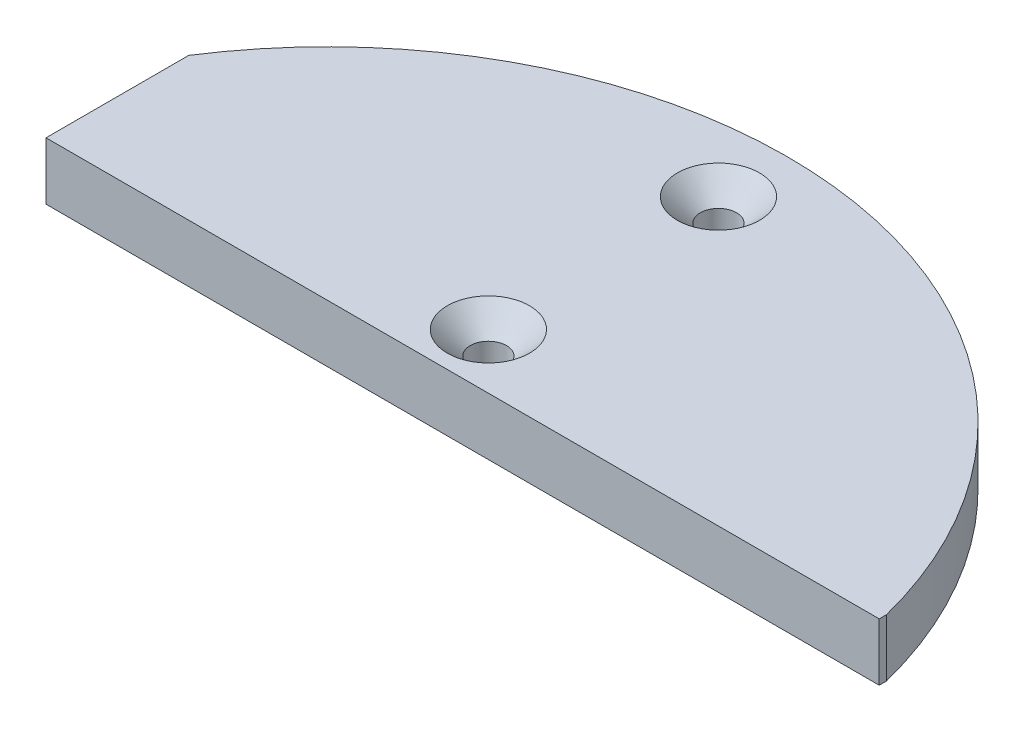
ISO-10303-21;
HEADER;
FILE_DESCRIPTION(('STEP AP214'),'2;1');
FILE_NAME('part.step','',(''),(''),'','','');
FILE_SCHEMA(('AUTOMOTIVE_DESIGN { 1 0 10303 214 1 1 1 1 }'));
ENDSEC;
DATA;
#1=APPLICATION_CONTEXT('core data for automotive mechanical design processes');
#2=APPLICATION_PROTOCOL_DEFINITION('international standard','automotive_design',2000,#1);
#3=PRODUCT_CONTEXT('',#1,'mechanical');
#4=PRODUCT('Part','Part','',(#3));
#5=PRODUCT_RELATED_PRODUCT_CATEGORY('part','',(#4));
#6=PRODUCT_DEFINITION_FORMATION('','',#4);
#7=PRODUCT_DEFINITION_CONTEXT('part definition',#1,'design');
#8=PRODUCT_DEFINITION('design','',#6,#7);
#9=PRODUCT_DEFINITION_SHAPE('','',#8);
#10=(LENGTH_UNIT() NAMED_UNIT(*) SI_UNIT(.MILLI.,.METRE.));
#11=(NAMED_UNIT(*) PLANE_ANGLE_UNIT() SI_UNIT($,.RADIAN.));
#12=(NAMED_UNIT(*) SI_UNIT($,.STERADIAN.) SOLID_ANGLE_UNIT());
#13=UNCERTAINTY_MEASURE_WITH_UNIT(LENGTH_MEASURE(1.E-05),#10,'distance_accuracy_value','');
#14=(GEOMETRIC_REPRESENTATION_CONTEXT(3) GLOBAL_UNCERTAINTY_ASSIGNED_CONTEXT((#13)) GLOBAL_UNIT_ASSIGNED_CONTEXT((#10,
#11,#12)) REPRESENTATION_CONTEXT('',''));
#15=CARTESIAN_POINT('',(0.,0.,0.));
#16=DIRECTION('',(0.,0.,1.));
#17=DIRECTION('',(1.,0.,0.));
#18=AXIS2_PLACEMENT_3D('',#15,#16,#17);
#19=CARTESIAN_POINT('',(0.,6.35,-11.684));
#20=DIRECTION('',(0.,0.,-1.));
#21=DIRECTION('',(-1.,0.,0.));
#22=AXIS2_PLACEMENT_3D('',#19,#20,#21);
#23=PLANE('',#22);
#24=DIRECTION('',(1.,0.,0.));
#25=VECTOR('',#24,1.);
#26=CARTESIAN_POINT('',(0.,0.,-11.684));
#27=LINE('',#26,#25);
#28=CARTESIAN_POINT('',(-42.746,0.,-11.684));
#29=VERTEX_POINT('',#28);
#30=CARTESIAN_POINT('',(49.2434251855589,0.,-11.684));
#31=VERTEX_POINT('',#30);
#32=EDGE_CURVE('E120',#29,#31,#27,.T.);
#33=ORIENTED_EDGE('',*,*,#32,.T.);
#34=DIRECTION('',(0.,-1.,0.));
#35=VECTOR('',#34,1.);
#36=CARTESIAN_POINT('',(49.2434251855589,6.35,-11.684));
#37=LINE('',#36,#35);
#38=CARTESIAN_POINT('',(49.2434251855589,6.35,-11.684));
#39=VERTEX_POINT('',#38);
#40=EDGE_CURVE('E106',#39,#31,#37,.T.);
#41=ORIENTED_EDGE('',*,*,#40,.F.);
#42=DIRECTION('',(1.,0.,0.));
#43=VECTOR('',#42,1.);
#44=CARTESIAN_POINT('',(0.,6.35,-11.684));
#45=LINE('',#44,#43);
#46=CARTESIAN_POINT('',(-42.746,6.35,-11.684));
#47=VERTEX_POINT('',#46);
#48=EDGE_CURVE('E97',#47,#39,#45,.T.);
#49=ORIENTED_EDGE('',*,*,#48,.F.);
#50=DIRECTION('',(0.,-1.,0.));
#51=VECTOR('',#50,1.);
#52=CARTESIAN_POINT('',(-42.746,6.35,-11.684));
#53=LINE('',#52,#51);
#54=EDGE_CURVE('E63',#47,#29,#53,.T.);
#55=ORIENTED_EDGE('',*,*,#54,.T.);
#56=EDGE_LOOP('',(#33,#41,#49,#55));
#57=FACE_BOUND('',#56,.T.);
#58=ADVANCED_FACE('F45',(#57),#23,.F.);
#59=CARTESIAN_POINT('',(49.2434251855589,6.35,0.));
#60=DIRECTION('',(-1.,0.,0.));
#61=DIRECTION('',(0.,0.,1.));
#62=AXIS2_PLACEMENT_3D('',#59,#60,#61);
#63=PLANE('',#62);
#64=DIRECTION('',(0.,0.,-1.));
#65=VECTOR('',#64,1.);
#66=CARTESIAN_POINT('',(49.2434251855589,0.,0.));
#67=LINE('',#66,#65);
#68=CARTESIAN_POINT('',(49.2434251855589,0.,-12.4789853751923));
#69=VERTEX_POINT('',#68);
#70=EDGE_CURVE('E103',#31,#69,#67,.T.);
#71=ORIENTED_EDGE('',*,*,#70,.T.);
#72=DIRECTION('',(0.,-1.,0.));
#73=VECTOR('',#72,1.);
#74=CARTESIAN_POINT('',(49.2434251855589,6.35,-12.4789853751923));
#75=LINE('',#74,#73);
#76=CARTESIAN_POINT('',(49.2434251855589,6.35,-12.4789853751923));
#77=VERTEX_POINT('',#76);
#78=EDGE_CURVE('E101',#77,#69,#75,.T.);
#79=ORIENTED_EDGE('',*,*,#78,.F.);
#80=DIRECTION('',(0.,0.,-1.));
#81=VECTOR('',#80,1.);
#82=CARTESIAN_POINT('',(49.2434251855589,6.35,0.));
#83=LINE('',#82,#81);
#84=EDGE_CURVE('E90',#39,#77,#83,.T.);
#85=ORIENTED_EDGE('',*,*,#84,.F.);
#86=ORIENTED_EDGE('',*,*,#40,.T.);
#87=EDGE_LOOP('',(#71,#79,#85,#86));
#88=FACE_BOUND('',#87,.T.);
#89=ADVANCED_FACE('F102',(#88),#63,.F.);
#90=CARTESIAN_POINT('',(0.,6.35,0.));
#91=DIRECTION('',(0.,-1.,0.));
#92=DIRECTION('',(0.,0.,-1.));
#93=AXIS2_PLACEMENT_3D('',#90,#91,#92);
#94=CYLINDRICAL_SURFACE('',#93,50.8);
#95=CARTESIAN_POINT('',(0.,0.,0.));
#96=DIRECTION('',(0.,1.,0.));
#97=DIRECTION('',(0.,0.,1.));
#98=AXIS2_PLACEMENT_3D('',#95,#96,#97);
#99=CIRCLE('',#98,50.8);
#100=CARTESIAN_POINT('',(-42.746,0.,-27.448487827201));
#101=VERTEX_POINT('',#100);
#102=EDGE_CURVE('E123',#69,#101,#99,.T.);
#103=ORIENTED_EDGE('',*,*,#102,.T.);
#104=DIRECTION('',(0.,-1.,0.));
#105=VECTOR('',#104,1.);
#106=CARTESIAN_POINT('',(-42.746,6.35,-27.448487827201));
#107=LINE('',#106,#105);
#108=CARTESIAN_POINT('',(-42.746,6.35,-27.448487827201));
#109=VERTEX_POINT('',#108);
#110=EDGE_CURVE('E78',#109,#101,#107,.T.);
#111=ORIENTED_EDGE('',*,*,#110,.F.);
#112=CARTESIAN_POINT('',(0.,6.35,0.));
#113=DIRECTION('',(0.,1.,0.));
#114=DIRECTION('',(0.,0.,1.));
#115=AXIS2_PLACEMENT_3D('',#112,#113,#114);
#116=CIRCLE('',#115,50.8);
#117=EDGE_CURVE('E96',#77,#109,#116,.T.);
#118=ORIENTED_EDGE('',*,*,#117,.F.);
#119=ORIENTED_EDGE('',*,*,#78,.T.);
#120=EDGE_LOOP('',(#103,#111,#118,#119));
#121=FACE_BOUND('',#120,.T.);
#122=ADVANCED_FACE('F108',(#121),#94,.T.);
#123=CARTESIAN_POINT('',(0.,6.35,-17.78));
#124=DIRECTION('',(0.,-1.,0.));
#125=DIRECTION('',(0.,0.,-1.));
#126=AXIS2_PLACEMENT_3D('',#123,#124,#125);
#127=CYLINDRICAL_SURFACE('',#126,2.);
#128=CARTESIAN_POINT('',(0.,3.80999999999996,-17.78));
#129=DIRECTION('',(0.,1.,0.));
#130=DIRECTION('',(0.,0.,1.));
#131=AXIS2_PLACEMENT_3D('',#128,#129,#130);
#132=CIRCLE('',#131,2.);
#133=CARTESIAN_POINT('',(0.,3.80999999999996,-15.78));
#134=VERTEX_POINT('',#133);
#135=EDGE_CURVE('E131',#134,#134,#132,.T.);
#136=ORIENTED_EDGE('',*,*,#135,.T.);
#137=EDGE_LOOP('',(#136));
#138=FACE_BOUND('',#137,.T.);
#139=CARTESIAN_POINT('',(0.,0.,-17.78));
#140=DIRECTION('',(0.,1.,0.));
#141=DIRECTION('',(0.,0.,1.));
#142=AXIS2_PLACEMENT_3D('',#139,#140,#141);
#143=CIRCLE('',#142,2.);
#144=CARTESIAN_POINT('',(0.,0.,-15.78));
#145=VERTEX_POINT('',#144);
#146=EDGE_CURVE('E117',#145,#145,#143,.T.);
#147=ORIENTED_EDGE('',*,*,#146,.F.);
#148=EDGE_LOOP('',(#147));
#149=FACE_BOUND('',#148,.T.);
#150=ADVANCED_FACE('F147',(#138,#149),#127,.F.);
#151=CARTESIAN_POINT('',(0.,6.35,-43.18));
#152=DIRECTION('',(0.,-1.,0.));
#153=DIRECTION('',(0.,0.,-1.));
#154=AXIS2_PLACEMENT_3D('',#151,#152,#153);
#155=CYLINDRICAL_SURFACE('',#154,2.);
#156=CARTESIAN_POINT('',(0.,3.81000000000001,-43.18));
#157=DIRECTION('',(0.,1.,0.));
#158=DIRECTION('',(0.,0.,1.));
#159=AXIS2_PLACEMENT_3D('',#156,#157,#158);
#160=CIRCLE('',#159,2.);
#161=CARTESIAN_POINT('',(0.,3.81000000000001,-41.18));
#162=VERTEX_POINT('',#161);
#163=EDGE_CURVE('E11',#162,#162,#160,.T.);
#164=ORIENTED_EDGE('',*,*,#163,.T.);
#165=EDGE_LOOP('',(#164));
#166=FACE_BOUND('',#165,.T.);
#167=CARTESIAN_POINT('',(0.,0.,-43.18));
#168=DIRECTION('',(0.,1.,0.));
#169=DIRECTION('',(0.,0.,1.));
#170=AXIS2_PLACEMENT_3D('',#167,#168,#169);
#171=CIRCLE('',#170,2.);
#172=CARTESIAN_POINT('',(0.,0.,-41.18));
#173=VERTEX_POINT('',#172);
#174=EDGE_CURVE('E114',#173,#173,#171,.T.);
#175=ORIENTED_EDGE('',*,*,#174,.F.);
#176=EDGE_LOOP('',(#175));
#177=FACE_BOUND('',#176,.T.);
#178=ADVANCED_FACE('F150',(#166,#177),#155,.F.);
#179=CARTESIAN_POINT('',(-42.746,6.35,0.));
#180=DIRECTION('',(-1.,0.,0.));
#181=DIRECTION('',(0.,0.,1.));
#182=AXIS2_PLACEMENT_3D('',#179,#180,#181);
#183=PLANE('',#182);
#184=DIRECTION('',(0.,0.,-1.));
#185=VECTOR('',#184,1.);
#186=CARTESIAN_POINT('',(-42.746,0.,0.));
#187=LINE('',#186,#185);
#188=EDGE_CURVE('E125',#29,#101,#187,.T.);
#189=ORIENTED_EDGE('',*,*,#188,.F.);
#190=ORIENTED_EDGE('',*,*,#54,.F.);
#191=DIRECTION('',(0.,0.,-1.));
#192=VECTOR('',#191,1.);
#193=CARTESIAN_POINT('',(-42.746,6.35,0.));
#194=LINE('',#193,#192);
#195=EDGE_CURVE('E109',#47,#109,#194,.T.);
#196=ORIENTED_EDGE('',*,*,#195,.T.);
#197=ORIENTED_EDGE('',*,*,#110,.T.);
#198=EDGE_LOOP('',(#189,#190,#196,#197));
#199=FACE_BOUND('',#198,.T.);
#200=ADVANCED_FACE('F158',(#199),#183,.T.);
#201=CARTESIAN_POINT('',(0.,6.35,0.));
#202=DIRECTION('',(0.,1.,0.));
#203=DIRECTION('',(0.,0.,1.));
#204=AXIS2_PLACEMENT_3D('',#201,#202,#203);
#205=PLANE('',#204);
#206=CARTESIAN_POINT('',(0.,6.35,-17.78));
#207=DIRECTION('',(0.,1.,0.));
#208=DIRECTION('',(0.,0.,1.));
#209=AXIS2_PLACEMENT_3D('',#206,#207,#208);
#210=CIRCLE('',#209,4.54000000000003);
#211=CARTESIAN_POINT('',(0.,6.35,-13.24));
#212=VERTEX_POINT('',#211);
#213=EDGE_CURVE('E55',#212,#212,#210,.F.);
#214=ORIENTED_EDGE('',*,*,#213,.T.);
#215=EDGE_LOOP('',(#214));
#216=FACE_BOUND('',#215,.T.);
#217=CARTESIAN_POINT('',(0.,6.35,-43.18));
#218=DIRECTION('',(0.,1.,0.));
#219=DIRECTION('',(0.,0.,1.));
#220=AXIS2_PLACEMENT_3D('',#217,#218,#219);
#221=CIRCLE('',#220,4.54);
#222=CARTESIAN_POINT('',(0.,6.35,-38.64));
#223=VERTEX_POINT('',#222);
#224=EDGE_CURVE('E134',#223,#223,#221,.F.);
#225=ORIENTED_EDGE('',*,*,#224,.T.);
#226=EDGE_LOOP('',(#225));
#227=FACE_BOUND('',#226,.T.);
#228=ORIENTED_EDGE('',*,*,#48,.T.);
#229=ORIENTED_EDGE('',*,*,#84,.T.);
#230=ORIENTED_EDGE('',*,*,#117,.T.);
#231=ORIENTED_EDGE('',*,*,#195,.F.);
#232=EDGE_LOOP('',(#228,#229,#230,#231));
#233=FACE_BOUND('',#232,.T.);
#234=ADVANCED_FACE('F93',(#216,#227,#233),#205,.T.);
#235=CARTESIAN_POINT('',(0.,0.,0.));
#236=DIRECTION('',(0.,1.,0.));
#237=DIRECTION('',(0.,0.,1.));
#238=AXIS2_PLACEMENT_3D('',#235,#236,#237);
#239=PLANE('',#238);
#240=ORIENTED_EDGE('',*,*,#174,.T.);
#241=EDGE_LOOP('',(#240));
#242=FACE_BOUND('',#241,.T.);
#243=ORIENTED_EDGE('',*,*,#146,.T.);
#244=EDGE_LOOP('',(#243));
#245=FACE_BOUND('',#244,.T.);
#246=ORIENTED_EDGE('',*,*,#32,.F.);
#247=ORIENTED_EDGE('',*,*,#188,.T.);
#248=ORIENTED_EDGE('',*,*,#102,.F.);
#249=ORIENTED_EDGE('',*,*,#70,.F.);
#250=EDGE_LOOP('',(#246,#247,#248,#249));
#251=FACE_BOUND('',#250,.T.);
#252=ADVANCED_FACE('F144',(#242,#245,#251),#239,.F.);
#253=CARTESIAN_POINT('',(0.,3.80999999999996,-17.78));
#254=DIRECTION('',(0.,1.,0.));
#255=DIRECTION('',(0.,0.,1.));
#256=AXIS2_PLACEMENT_3D('',#253,#254,#255);
#257=CONICAL_SURFACE('',#256,2.,0.785398163397447);
#258=ORIENTED_EDGE('',*,*,#213,.F.);
#259=EDGE_LOOP('',(#258));
#260=FACE_BOUND('',#259,.T.);
#261=ORIENTED_EDGE('',*,*,#135,.F.);
#262=EDGE_LOOP('',(#261));
#263=FACE_BOUND('',#262,.T.);
#264=ADVANCED_FACE('F141',(#260,#263),#257,.F.);
#265=CARTESIAN_POINT('',(0.,3.81000000000001,-43.18));
#266=DIRECTION('',(0.,1.,0.));
#267=DIRECTION('',(0.,0.,1.));
#268=AXIS2_PLACEMENT_3D('',#265,#266,#267);
#269=CONICAL_SURFACE('',#268,2.,0.78539816339745);
#270=ORIENTED_EDGE('',*,*,#224,.F.);
#271=EDGE_LOOP('',(#270));
#272=FACE_BOUND('',#271,.T.);
#273=ORIENTED_EDGE('',*,*,#163,.F.);
#274=EDGE_LOOP('',(#273));
#275=FACE_BOUND('',#274,.T.);
#276=ADVANCED_FACE('F48',(#272,#275),#269,.F.);
#277=CLOSED_SHELL('',(#58,#89,#122,#150,#178,#200,#234,#252,#264,#276));
#278=MANIFOLD_SOLID_BREP('B2',#277);
#279=ADVANCED_BREP_SHAPE_REPRESENTATION('',(#18,#278),#14);
#280=SHAPE_DEFINITION_REPRESENTATION(#9,#279);
ENDSEC;
END-ISO-10303-21;
